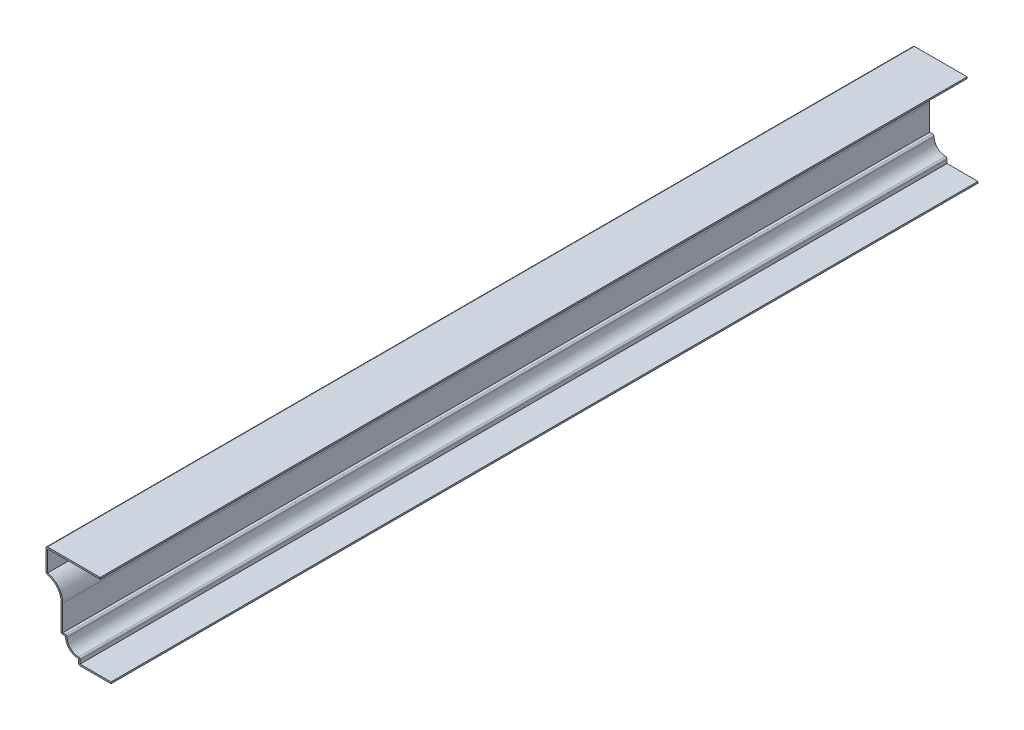
ISO-10303-21;
HEADER;
FILE_DESCRIPTION(('STEP AP214'),'2;1');
FILE_NAME('part.step','',(''),(''),'','','');
FILE_SCHEMA(('AUTOMOTIVE_DESIGN { 1 0 10303 214 1 1 1 1 }'));
ENDSEC;
DATA;
#1=APPLICATION_CONTEXT('core data for automotive mechanical design processes');
#2=APPLICATION_PROTOCOL_DEFINITION('international standard','automotive_design',2000,#1);
#3=PRODUCT_CONTEXT('',#1,'mechanical');
#4=PRODUCT('Part','Part','',(#3));
#5=PRODUCT_RELATED_PRODUCT_CATEGORY('part','',(#4));
#6=PRODUCT_DEFINITION_FORMATION('','',#4);
#7=PRODUCT_DEFINITION_CONTEXT('part definition',#1,'design');
#8=PRODUCT_DEFINITION('design','',#6,#7);
#9=PRODUCT_DEFINITION_SHAPE('','',#8);
#10=(LENGTH_UNIT() NAMED_UNIT(*) SI_UNIT(.MILLI.,.METRE.));
#11=(NAMED_UNIT(*) PLANE_ANGLE_UNIT() SI_UNIT($,.RADIAN.));
#12=(NAMED_UNIT(*) SI_UNIT($,.STERADIAN.) SOLID_ANGLE_UNIT());
#13=UNCERTAINTY_MEASURE_WITH_UNIT(LENGTH_MEASURE(1.E-05),#10,'distance_accuracy_value','');
#14=(GEOMETRIC_REPRESENTATION_CONTEXT(3) GLOBAL_UNCERTAINTY_ASSIGNED_CONTEXT((#13)) GLOBAL_UNIT_ASSIGNED_CONTEXT((#10,
#11,#12)) REPRESENTATION_CONTEXT('',''));
#15=CARTESIAN_POINT('',(0.,0.,0.));
#16=DIRECTION('',(0.,0.,1.));
#17=DIRECTION('',(1.,0.,0.));
#18=AXIS2_PLACEMENT_3D('',#15,#16,#17);
#19=CARTESIAN_POINT('',(-47.625,62.357,-635.));
#20=DIRECTION('',(0.,-1.,0.));
#21=DIRECTION('',(0.,0.,-1.));
#22=AXIS2_PLACEMENT_3D('',#19,#20,#21);
#23=PLANE('',#22);
#24=DIRECTION('',(1.,0.,0.));
#25=VECTOR('',#24,1.);
#26=CARTESIAN_POINT('',(-47.625,62.357,0.));
#27=LINE('',#26,#25);
#28=CARTESIAN_POINT('',(-46.482,62.357,0.));
#29=VERTEX_POINT('',#28);
#30=CARTESIAN_POINT('',(-7.9375,62.357,0.));
#31=VERTEX_POINT('',#30);
#32=EDGE_CURVE('E265',#29,#31,#27,.T.);
#33=ORIENTED_EDGE('',*,*,#32,.F.);
#34=DIRECTION('',(0.,0.,1.));
#35=VECTOR('',#34,1.);
#36=CARTESIAN_POINT('',(-46.482,62.357,-635.));
#37=LINE('',#36,#35);
#38=CARTESIAN_POINT('',(-46.482,62.357,-635.));
#39=VERTEX_POINT('',#38);
#40=EDGE_CURVE('E221',#39,#29,#37,.T.);
#41=ORIENTED_EDGE('',*,*,#40,.F.);
#42=DIRECTION('',(1.,0.,0.));
#43=VECTOR('',#42,1.);
#44=CARTESIAN_POINT('',(-47.625,62.357,-635.));
#45=LINE('',#44,#43);
#46=CARTESIAN_POINT('',(-7.9375,62.357,-635.));
#47=VERTEX_POINT('',#46);
#48=EDGE_CURVE('E203',#39,#47,#45,.T.);
#49=ORIENTED_EDGE('',*,*,#48,.T.);
#50=DIRECTION('',(0.,0.,1.));
#51=VECTOR('',#50,1.);
#52=CARTESIAN_POINT('',(-7.9375,62.357,-635.));
#53=LINE('',#52,#51);
#54=EDGE_CURVE('E211',#47,#31,#53,.T.);
#55=ORIENTED_EDGE('',*,*,#54,.T.);
#56=EDGE_LOOP('',(#33,#41,#49,#55));
#57=FACE_BOUND('',#56,.T.);
#58=ADVANCED_FACE('F35',(#57),#23,.T.);
#59=CARTESIAN_POINT('',(-46.482,46.0375,-635.));
#60=DIRECTION('',(1.,0.,0.));
#61=DIRECTION('',(0.,0.,-1.));
#62=AXIS2_PLACEMENT_3D('',#59,#60,#61);
#63=PLANE('',#62);
#64=DIRECTION('',(0.,1.,0.));
#65=VECTOR('',#64,1.);
#66=CARTESIAN_POINT('',(-46.482,46.0375,0.));
#67=LINE('',#66,#65);
#68=CARTESIAN_POINT('',(-46.482,47.0081454045131,0.));
#69=VERTEX_POINT('',#68);
#70=EDGE_CURVE('E222',#69,#29,#67,.T.);
#71=ORIENTED_EDGE('',*,*,#70,.F.);
#72=DIRECTION('',(0.,0.,1.));
#73=VECTOR('',#72,1.);
#74=CARTESIAN_POINT('',(-46.482,47.0081454045131,-635.));
#75=LINE('',#74,#73);
#76=CARTESIAN_POINT('',(-46.482,47.0081454045131,-635.));
#77=VERTEX_POINT('',#76);
#78=EDGE_CURVE('E307',#77,#69,#75,.T.);
#79=ORIENTED_EDGE('',*,*,#78,.F.);
#80=DIRECTION('',(0.,1.,0.));
#81=VECTOR('',#80,1.);
#82=CARTESIAN_POINT('',(-46.482,46.0375,-635.));
#83=LINE('',#82,#81);
#84=EDGE_CURVE('E219',#77,#39,#83,.T.);
#85=ORIENTED_EDGE('',*,*,#84,.T.);
#86=ORIENTED_EDGE('',*,*,#40,.T.);
#87=EDGE_LOOP('',(#71,#79,#85,#86));
#88=FACE_BOUND('',#87,.T.);
#89=ADVANCED_FACE('F400',(#88),#63,.T.);
#90=CARTESIAN_POINT('',(-49.2125,33.4371093810549,-635.));
#91=DIRECTION('',(0.,0.,1.));
#92=DIRECTION('',(1.,0.,0.));
#93=AXIS2_PLACEMENT_3D('',#90,#91,#92);
#94=CYLINDRICAL_SURFACE('',#93,13.843);
#95=CARTESIAN_POINT('',(-49.2125,33.4371093810549,0.));
#96=DIRECTION('',(0.,0.,1.));
#97=DIRECTION('',(1.,0.,0.));
#98=AXIS2_PLACEMENT_3D('',#95,#96,#97);
#99=CIRCLE('',#98,13.843);
#100=CARTESIAN_POINT('',(-35.3695,33.4371093810549,0.));
#101=VERTEX_POINT('',#100);
#102=EDGE_CURVE('E225',#101,#69,#99,.T.);
#103=ORIENTED_EDGE('',*,*,#102,.F.);
#104=DIRECTION('',(0.,0.,1.));
#105=VECTOR('',#104,1.);
#106=CARTESIAN_POINT('',(-35.3695,33.4371093810549,-635.));
#107=LINE('',#106,#105);
#108=CARTESIAN_POINT('',(-35.3695,33.4371093810549,-635.));
#109=VERTEX_POINT('',#108);
#110=EDGE_CURVE('E309',#109,#101,#107,.T.);
#111=ORIENTED_EDGE('',*,*,#110,.F.);
#112=CARTESIAN_POINT('',(-49.2125,33.4371093810549,-635.));
#113=DIRECTION('',(0.,0.,1.));
#114=DIRECTION('',(1.,0.,0.));
#115=AXIS2_PLACEMENT_3D('',#112,#113,#114);
#116=CIRCLE('',#115,13.843);
#117=EDGE_CURVE('E261',#109,#77,#116,.T.);
#118=ORIENTED_EDGE('',*,*,#117,.T.);
#119=ORIENTED_EDGE('',*,*,#78,.T.);
#120=EDGE_LOOP('',(#103,#111,#118,#119));
#121=FACE_BOUND('',#120,.T.);
#122=ADVANCED_FACE('F481',(#121),#94,.T.);
#123=CARTESIAN_POINT('',(-35.3695,13.49375,-635.));
#124=DIRECTION('',(1.,0.,0.));
#125=DIRECTION('',(0.,1.,0.));
#126=AXIS2_PLACEMENT_3D('',#123,#124,#125);
#127=PLANE('',#126);
#128=DIRECTION('',(0.,1.,0.));
#129=VECTOR('',#128,1.);
#130=CARTESIAN_POINT('',(-35.3695,13.49375,0.));
#131=LINE('',#130,#129);
#132=CARTESIAN_POINT('',(-35.3695,14.63675,0.));
#133=VERTEX_POINT('',#132);
#134=EDGE_CURVE('E300',#133,#101,#131,.T.);
#135=ORIENTED_EDGE('',*,*,#134,.F.);
#136=DIRECTION('',(0.,0.,1.));
#137=VECTOR('',#136,1.);
#138=CARTESIAN_POINT('',(-35.3695,14.63675,-635.));
#139=LINE('',#138,#137);
#140=CARTESIAN_POINT('',(-35.3695,14.63675,-635.));
#141=VERTEX_POINT('',#140);
#142=EDGE_CURVE('E311',#141,#133,#139,.T.);
#143=ORIENTED_EDGE('',*,*,#142,.F.);
#144=DIRECTION('',(0.,1.,0.));
#145=VECTOR('',#144,1.);
#146=CARTESIAN_POINT('',(-35.3695,13.49375,-635.));
#147=LINE('',#146,#145);
#148=EDGE_CURVE('E258',#141,#109,#147,.T.);
#149=ORIENTED_EDGE('',*,*,#148,.T.);
#150=ORIENTED_EDGE('',*,*,#110,.T.);
#151=EDGE_LOOP('',(#135,#143,#149,#150));
#152=FACE_BOUND('',#151,.T.);
#153=ADVANCED_FACE('F408',(#152),#127,.T.);
#154=CARTESIAN_POINT('',(-33.3375,14.63675,-635.));
#155=DIRECTION('',(0.,1.,0.));
#156=DIRECTION('',(0.,0.,1.));
#157=AXIS2_PLACEMENT_3D('',#154,#155,#156);
#158=PLANE('',#157);
#159=DIRECTION('',(1.,0.,0.));
#160=VECTOR('',#159,1.);
#161=CARTESIAN_POINT('',(-33.3375,14.63675,0.));
#162=LINE('',#161,#160);
#163=CARTESIAN_POINT('',(-33.3375,14.63675,0.));
#164=VERTEX_POINT('',#163);
#165=EDGE_CURVE('E298',#164,#133,#162,.F.);
#166=ORIENTED_EDGE('',*,*,#165,.F.);
#167=DIRECTION('',(0.,0.,1.));
#168=VECTOR('',#167,1.);
#169=CARTESIAN_POINT('',(-33.3375,14.63675,-635.));
#170=LINE('',#169,#168);
#171=CARTESIAN_POINT('',(-33.3375,14.63675,-635.));
#172=VERTEX_POINT('',#171);
#173=EDGE_CURVE('E366',#164,#172,#170,.F.);
#174=ORIENTED_EDGE('',*,*,#173,.T.);
#175=DIRECTION('',(1.,0.,0.));
#176=VECTOR('',#175,1.);
#177=CARTESIAN_POINT('',(-33.3375,14.63675,-635.));
#178=LINE('',#177,#176);
#179=EDGE_CURVE('E256',#172,#141,#178,.F.);
#180=ORIENTED_EDGE('',*,*,#179,.T.);
#181=ORIENTED_EDGE('',*,*,#142,.T.);
#182=EDGE_LOOP('',(#166,#174,#180,#181));
#183=FACE_BOUND('',#182,.T.);
#184=ADVANCED_FACE('F411',(#183),#158,.T.);
#185=CARTESIAN_POINT('',(-23.8125,13.49375,-635.));
#186=DIRECTION('',(0.,0.,1.));
#187=DIRECTION('',(1.,0.,0.));
#188=AXIS2_PLACEMENT_3D('',#185,#186,#187);
#189=CYLINDRICAL_SURFACE('',#188,8.382);
#190=CARTESIAN_POINT('',(-23.8125,13.49375,0.));
#191=DIRECTION('',(0.,0.,1.));
#192=DIRECTION('',(1.,0.,0.));
#193=AXIS2_PLACEMENT_3D('',#190,#191,#192);
#194=CIRCLE('',#193,8.382);
#195=CARTESIAN_POINT('',(-23.8125,5.11175,0.));
#196=VERTEX_POINT('',#195);
#197=CARTESIAN_POINT('',(-32.1945,13.49375,0.));
#198=VERTEX_POINT('',#197);
#199=EDGE_CURVE('E295',#196,#198,#194,.F.);
#200=ORIENTED_EDGE('',*,*,#199,.F.);
#201=DIRECTION('',(0.,0.,1.));
#202=VECTOR('',#201,1.);
#203=CARTESIAN_POINT('',(-23.8125,5.11175,-635.));
#204=LINE('',#203,#202);
#205=CARTESIAN_POINT('',(-23.8125,5.11175,-635.));
#206=VERTEX_POINT('',#205);
#207=EDGE_CURVE('E364',#196,#206,#204,.F.);
#208=ORIENTED_EDGE('',*,*,#207,.T.);
#209=CARTESIAN_POINT('',(-23.8125,13.49375,-635.));
#210=DIRECTION('',(0.,0.,1.));
#211=DIRECTION('',(1.,0.,0.));
#212=AXIS2_PLACEMENT_3D('',#209,#210,#211);
#213=CIRCLE('',#212,8.382);
#214=CARTESIAN_POINT('',(-32.1945,13.49375,-635.));
#215=VERTEX_POINT('',#214);
#216=EDGE_CURVE('E253',#206,#215,#213,.F.);
#217=ORIENTED_EDGE('',*,*,#216,.T.);
#218=DIRECTION('',(0.,0.,1.));
#219=VECTOR('',#218,1.);
#220=CARTESIAN_POINT('',(-32.1945,13.49375,-635.));
#221=LINE('',#220,#219);
#222=EDGE_CURVE('E361',#215,#198,#221,.T.);
#223=ORIENTED_EDGE('',*,*,#222,.T.);
#224=EDGE_LOOP('',(#200,#208,#217,#223));
#225=FACE_BOUND('',#224,.T.);
#226=ADVANCED_FACE('F420',(#225),#189,.F.);
#227=CARTESIAN_POINT('',(-22.6695,0.,-635.));
#228=DIRECTION('',(1.,0.,0.));
#229=DIRECTION('',(0.,0.,-1.));
#230=AXIS2_PLACEMENT_3D('',#227,#228,#229);
#231=PLANE('',#230);
#232=DIRECTION('',(0.,1.,0.));
#233=VECTOR('',#232,1.);
#234=CARTESIAN_POINT('',(-22.6695,0.,-635.));
#235=LINE('',#234,#233);
#236=CARTESIAN_POINT('',(-22.6695,1.143,-635.));
#237=VERTEX_POINT('',#236);
#238=CARTESIAN_POINT('',(-22.6695,3.96875,-635.));
#239=VERTEX_POINT('',#238);
#240=EDGE_CURVE('E250',#237,#239,#235,.T.);
#241=ORIENTED_EDGE('',*,*,#240,.T.);
#242=DIRECTION('',(0.,0.,1.));
#243=VECTOR('',#242,1.);
#244=CARTESIAN_POINT('',(-22.6695,3.96875,-635.));
#245=LINE('',#244,#243);
#246=CARTESIAN_POINT('',(-22.6695,3.96875,0.));
#247=VERTEX_POINT('',#246);
#248=EDGE_CURVE('E358',#239,#247,#245,.T.);
#249=ORIENTED_EDGE('',*,*,#248,.T.);
#250=DIRECTION('',(0.,1.,0.));
#251=VECTOR('',#250,1.);
#252=CARTESIAN_POINT('',(-22.6695,0.,0.));
#253=LINE('',#252,#251);
#254=CARTESIAN_POINT('',(-22.6695,1.143,0.));
#255=VERTEX_POINT('',#254);
#256=EDGE_CURVE('E292',#255,#247,#253,.T.);
#257=ORIENTED_EDGE('',*,*,#256,.F.);
#258=DIRECTION('',(0.,0.,1.));
#259=VECTOR('',#258,1.);
#260=CARTESIAN_POINT('',(-22.6695,1.143,-635.));
#261=LINE('',#260,#259);
#262=EDGE_CURVE('E314',#237,#255,#261,.T.);
#263=ORIENTED_EDGE('',*,*,#262,.F.);
#264=EDGE_LOOP('',(#241,#249,#257,#263));
#265=FACE_BOUND('',#264,.T.);
#266=ADVANCED_FACE('F428',(#265),#231,.T.);
#267=CARTESIAN_POINT('',(0.,1.143,-635.));
#268=DIRECTION('',(0.,1.,0.));
#269=DIRECTION('',(-1.,0.,0.));
#270=AXIS2_PLACEMENT_3D('',#267,#268,#269);
#271=PLANE('',#270);
#272=DIRECTION('',(-1.,0.,0.));
#273=VECTOR('',#272,1.);
#274=CARTESIAN_POINT('',(0.,1.143,0.));
#275=LINE('',#274,#273);
#276=CARTESIAN_POINT('',(0.,1.143,0.));
#277=VERTEX_POINT('',#276);
#278=EDGE_CURVE('E289',#277,#255,#275,.T.);
#279=ORIENTED_EDGE('',*,*,#278,.F.);
#280=DIRECTION('',(0.,0.,1.));
#281=VECTOR('',#280,1.);
#282=CARTESIAN_POINT('',(0.,1.143,-635.));
#283=LINE('',#282,#281);
#284=CARTESIAN_POINT('',(0.,1.143,-635.));
#285=VERTEX_POINT('',#284);
#286=EDGE_CURVE('E316',#285,#277,#283,.T.);
#287=ORIENTED_EDGE('',*,*,#286,.F.);
#288=DIRECTION('',(-1.,0.,0.));
#289=VECTOR('',#288,1.);
#290=CARTESIAN_POINT('',(0.,1.143,-635.));
#291=LINE('',#290,#289);
#292=EDGE_CURVE('E247',#285,#237,#291,.T.);
#293=ORIENTED_EDGE('',*,*,#292,.T.);
#294=ORIENTED_EDGE('',*,*,#262,.T.);
#295=EDGE_LOOP('',(#279,#287,#293,#294));
#296=FACE_BOUND('',#295,.T.);
#297=ADVANCED_FACE('F433',(#296),#271,.T.);
#298=CARTESIAN_POINT('',(0.,1.143,-635.));
#299=DIRECTION('',(-1.,0.,0.));
#300=DIRECTION('',(0.,-1.,0.));
#301=AXIS2_PLACEMENT_3D('',#298,#299,#300);
#302=PLANE('',#301);
#303=DIRECTION('',(0.,-1.,0.));
#304=VECTOR('',#303,1.);
#305=CARTESIAN_POINT('',(0.,1.143,0.));
#306=LINE('',#305,#304);
#307=CARTESIAN_POINT('',(0.,0.,0.));
#308=VERTEX_POINT('',#307);
#309=EDGE_CURVE('E287',#277,#308,#306,.T.);
#310=ORIENTED_EDGE('',*,*,#309,.T.);
#311=DIRECTION('',(0.,0.,1.));
#312=VECTOR('',#311,1.);
#313=CARTESIAN_POINT('',(0.,0.,-635.));
#314=LINE('',#313,#312);
#315=CARTESIAN_POINT('',(0.,0.,-635.));
#316=VERTEX_POINT('',#315);
#317=EDGE_CURVE('E318',#316,#308,#314,.T.);
#318=ORIENTED_EDGE('',*,*,#317,.F.);
#319=DIRECTION('',(0.,-1.,0.));
#320=VECTOR('',#319,1.);
#321=CARTESIAN_POINT('',(0.,1.143,-635.));
#322=LINE('',#321,#320);
#323=EDGE_CURVE('E245',#285,#316,#322,.T.);
#324=ORIENTED_EDGE('',*,*,#323,.F.);
#325=ORIENTED_EDGE('',*,*,#286,.T.);
#326=EDGE_LOOP('',(#310,#318,#324,#325));
#327=FACE_BOUND('',#326,.T.);
#328=ADVANCED_FACE('F438',(#327),#302,.F.);
#329=CARTESIAN_POINT('',(0.,0.,-635.));
#330=DIRECTION('',(0.,1.,0.));
#331=DIRECTION('',(-1.,0.,0.));
#332=AXIS2_PLACEMENT_3D('',#329,#330,#331);
#333=PLANE('',#332);
#334=DIRECTION('',(-1.,0.,0.));
#335=VECTOR('',#334,1.);
#336=CARTESIAN_POINT('',(0.,0.,0.));
#337=LINE('',#336,#335);
#338=CARTESIAN_POINT('',(-22.6695,0.,0.));
#339=VERTEX_POINT('',#338);
#340=EDGE_CURVE('E284',#308,#339,#337,.T.);
#341=ORIENTED_EDGE('',*,*,#340,.T.);
#342=DIRECTION('',(0.,0.,1.));
#343=VECTOR('',#342,1.);
#344=CARTESIAN_POINT('',(-22.6695,0.,-635.));
#345=LINE('',#344,#343);
#346=CARTESIAN_POINT('',(-22.6695,0.,-635.));
#347=VERTEX_POINT('',#346);
#348=EDGE_CURVE('E345',#339,#347,#345,.F.);
#349=ORIENTED_EDGE('',*,*,#348,.T.);
#350=DIRECTION('',(-1.,0.,0.));
#351=VECTOR('',#350,1.);
#352=CARTESIAN_POINT('',(0.,0.,-635.));
#353=LINE('',#352,#351);
#354=EDGE_CURVE('E243',#316,#347,#353,.T.);
#355=ORIENTED_EDGE('',*,*,#354,.F.);
#356=ORIENTED_EDGE('',*,*,#317,.T.);
#357=EDGE_LOOP('',(#341,#349,#355,#356));
#358=FACE_BOUND('',#357,.T.);
#359=ADVANCED_FACE('F588',(#358),#333,.F.);
#360=CARTESIAN_POINT('',(-23.8125,0.,-635.));
#361=DIRECTION('',(1.,0.,0.));
#362=DIRECTION('',(0.,0.,-1.));
#363=AXIS2_PLACEMENT_3D('',#360,#361,#362);
#364=PLANE('',#363);
#365=DIRECTION('',(0.,1.,0.));
#366=VECTOR('',#365,1.);
#367=CARTESIAN_POINT('',(-23.8125,0.,-635.));
#368=LINE('',#367,#366);
#369=CARTESIAN_POINT('',(-23.8125,1.143,-635.));
#370=VERTEX_POINT('',#369);
#371=CARTESIAN_POINT('',(-23.8125,3.96875,-635.));
#372=VERTEX_POINT('',#371);
#373=EDGE_CURVE('E241',#370,#372,#368,.T.);
#374=ORIENTED_EDGE('',*,*,#373,.F.);
#375=DIRECTION('',(0.,0.,1.));
#376=VECTOR('',#375,1.);
#377=CARTESIAN_POINT('',(-23.8125,1.143,-635.));
#378=LINE('',#377,#376);
#379=CARTESIAN_POINT('',(-23.8125,1.143,0.));
#380=VERTEX_POINT('',#379);
#381=EDGE_CURVE('E306',#370,#380,#378,.T.);
#382=ORIENTED_EDGE('',*,*,#381,.T.);
#383=DIRECTION('',(0.,1.,0.));
#384=VECTOR('',#383,1.);
#385=CARTESIAN_POINT('',(-23.8125,0.,0.));
#386=LINE('',#385,#384);
#387=CARTESIAN_POINT('',(-23.8125,3.96875,0.));
#388=VERTEX_POINT('',#387);
#389=EDGE_CURVE('E282',#380,#388,#386,.T.);
#390=ORIENTED_EDGE('',*,*,#389,.T.);
#391=DIRECTION('',(0.,0.,1.));
#392=VECTOR('',#391,1.);
#393=CARTESIAN_POINT('',(-23.8125,3.96875,-635.));
#394=LINE('',#393,#392);
#395=EDGE_CURVE('E321',#372,#388,#394,.T.);
#396=ORIENTED_EDGE('',*,*,#395,.F.);
#397=EDGE_LOOP('',(#374,#382,#390,#396));
#398=FACE_BOUND('',#397,.T.);
#399=ADVANCED_FACE('F448',(#398),#364,.F.);
#400=CARTESIAN_POINT('',(-23.8125,13.49375,-635.));
#401=DIRECTION('',(0.,0.,1.));
#402=DIRECTION('',(1.,0.,0.));
#403=AXIS2_PLACEMENT_3D('',#400,#401,#402);
#404=CYLINDRICAL_SURFACE('',#403,9.525);
#405=CARTESIAN_POINT('',(-23.8125,13.49375,0.));
#406=DIRECTION('',(0.,0.,-1.));
#407=DIRECTION('',(-1.,0.,0.));
#408=AXIS2_PLACEMENT_3D('',#405,#406,#407);
#409=CIRCLE('',#408,9.525);
#410=CARTESIAN_POINT('',(-33.3375,13.49375,0.));
#411=VERTEX_POINT('',#410);
#412=EDGE_CURVE('E280',#388,#411,#409,.T.);
#413=ORIENTED_EDGE('',*,*,#412,.T.);
#414=DIRECTION('',(0.,0.,1.));
#415=VECTOR('',#414,1.);
#416=CARTESIAN_POINT('',(-33.3375,13.49375,-635.));
#417=LINE('',#416,#415);
#418=CARTESIAN_POINT('',(-33.3375,13.49375,-635.));
#419=VERTEX_POINT('',#418);
#420=EDGE_CURVE('E324',#419,#411,#417,.T.);
#421=ORIENTED_EDGE('',*,*,#420,.F.);
#422=CARTESIAN_POINT('',(-23.8125,13.49375,-635.));
#423=DIRECTION('',(0.,0.,-1.));
#424=DIRECTION('',(-1.,0.,0.));
#425=AXIS2_PLACEMENT_3D('',#422,#423,#424);
#426=CIRCLE('',#425,9.525);
#427=EDGE_CURVE('E239',#372,#419,#426,.T.);
#428=ORIENTED_EDGE('',*,*,#427,.F.);
#429=ORIENTED_EDGE('',*,*,#395,.T.);
#430=EDGE_LOOP('',(#413,#421,#428,#429));
#431=FACE_BOUND('',#430,.T.);
#432=ADVANCED_FACE('F455',(#431),#404,.T.);
#433=CARTESIAN_POINT('',(-33.3375,13.49375,-635.));
#434=DIRECTION('',(0.,1.,0.));
#435=DIRECTION('',(0.,0.,1.));
#436=AXIS2_PLACEMENT_3D('',#433,#434,#435);
#437=PLANE('',#436);
#438=DIRECTION('',(-1.,0.,0.));
#439=VECTOR('',#438,1.);
#440=CARTESIAN_POINT('',(-33.3375,13.49375,0.));
#441=LINE('',#440,#439);
#442=CARTESIAN_POINT('',(-35.3695,13.49375,0.));
#443=VERTEX_POINT('',#442);
#444=EDGE_CURVE('E277',#411,#443,#441,.T.);
#445=ORIENTED_EDGE('',*,*,#444,.T.);
#446=DIRECTION('',(0.,0.,1.));
#447=VECTOR('',#446,1.);
#448=CARTESIAN_POINT('',(-35.3695,13.49375,-635.));
#449=LINE('',#448,#447);
#450=CARTESIAN_POINT('',(-35.3695,13.49375,-635.));
#451=VERTEX_POINT('',#450);
#452=EDGE_CURVE('E371',#443,#451,#449,.F.);
#453=ORIENTED_EDGE('',*,*,#452,.T.);
#454=DIRECTION('',(-1.,0.,0.));
#455=VECTOR('',#454,1.);
#456=CARTESIAN_POINT('',(-33.3375,13.49375,-635.));
#457=LINE('',#456,#455);
#458=EDGE_CURVE('E236',#419,#451,#457,.T.);
#459=ORIENTED_EDGE('',*,*,#458,.F.);
#460=ORIENTED_EDGE('',*,*,#420,.T.);
#461=EDGE_LOOP('',(#445,#453,#459,#460));
#462=FACE_BOUND('',#461,.T.);
#463=ADVANCED_FACE('F459',(#462),#437,.F.);
#464=CARTESIAN_POINT('',(-36.5125,13.49375,-635.));
#465=DIRECTION('',(1.,0.,0.));
#466=DIRECTION('',(0.,1.,0.));
#467=AXIS2_PLACEMENT_3D('',#464,#465,#466);
#468=PLANE('',#467);
#469=DIRECTION('',(0.,1.,0.));
#470=VECTOR('',#469,1.);
#471=CARTESIAN_POINT('',(-36.5125,13.49375,-635.));
#472=LINE('',#471,#470);
#473=CARTESIAN_POINT('',(-36.5125,14.63675,-635.));
#474=VERTEX_POINT('',#473);
#475=CARTESIAN_POINT('',(-36.5125,33.4371093810549,-635.));
#476=VERTEX_POINT('',#475);
#477=EDGE_CURVE('E234',#474,#476,#472,.T.);
#478=ORIENTED_EDGE('',*,*,#477,.F.);
#479=DIRECTION('',(0.,0.,1.));
#480=VECTOR('',#479,1.);
#481=CARTESIAN_POINT('',(-36.5125,14.63675,-635.));
#482=LINE('',#481,#480);
#483=CARTESIAN_POINT('',(-36.5125,14.63675,0.));
#484=VERTEX_POINT('',#483);
#485=EDGE_CURVE('E368',#474,#484,#482,.T.);
#486=ORIENTED_EDGE('',*,*,#485,.T.);
#487=DIRECTION('',(0.,1.,0.));
#488=VECTOR('',#487,1.);
#489=CARTESIAN_POINT('',(-36.5125,13.49375,0.));
#490=LINE('',#489,#488);
#491=CARTESIAN_POINT('',(-36.5125,33.4371093810549,0.));
#492=VERTEX_POINT('',#491);
#493=EDGE_CURVE('E275',#484,#492,#490,.T.);
#494=ORIENTED_EDGE('',*,*,#493,.T.);
#495=DIRECTION('',(0.,0.,1.));
#496=VECTOR('',#495,1.);
#497=CARTESIAN_POINT('',(-36.5125,33.4371093810549,-635.));
#498=LINE('',#497,#496);
#499=EDGE_CURVE('E327',#476,#492,#498,.T.);
#500=ORIENTED_EDGE('',*,*,#499,.F.);
#501=EDGE_LOOP('',(#478,#486,#494,#500));
#502=FACE_BOUND('',#501,.T.);
#503=ADVANCED_FACE('F467',(#502),#468,.F.);
#504=CARTESIAN_POINT('',(-49.2125,33.4371093810549,-635.));
#505=DIRECTION('',(0.,0.,1.));
#506=DIRECTION('',(1.,0.,0.));
#507=AXIS2_PLACEMENT_3D('',#504,#505,#506);
#508=CYLINDRICAL_SURFACE('',#507,12.7);
#509=CARTESIAN_POINT('',(-49.2125,33.4371093810549,0.));
#510=DIRECTION('',(0.,0.,1.));
#511=DIRECTION('',(1.,0.,0.));
#512=AXIS2_PLACEMENT_3D('',#509,#510,#511);
#513=CIRCLE('',#512,12.7);
#514=CARTESIAN_POINT('',(-46.7074541284404,45.8876011456954,0.));
#515=VERTEX_POINT('',#514);
#516=EDGE_CURVE('E272',#492,#515,#513,.T.);
#517=ORIENTED_EDGE('',*,*,#516,.T.);
#518=DIRECTION('',(0.,0.,1.));
#519=VECTOR('',#518,1.);
#520=CARTESIAN_POINT('',(-46.7074541284404,45.8876011456954,-635.));
#521=LINE('',#520,#519);
#522=CARTESIAN_POINT('',(-46.7074541284404,45.8876011456954,-635.));
#523=VERTEX_POINT('',#522);
#524=EDGE_CURVE('E43',#515,#523,#521,.F.);
#525=ORIENTED_EDGE('',*,*,#524,.T.);
#526=CARTESIAN_POINT('',(-49.2125,33.4371093810549,-635.));
#527=DIRECTION('',(0.,0.,1.));
#528=DIRECTION('',(1.,0.,0.));
#529=AXIS2_PLACEMENT_3D('',#526,#527,#528);
#530=CIRCLE('',#529,12.7);
#531=EDGE_CURVE('E231',#476,#523,#530,.T.);
#532=ORIENTED_EDGE('',*,*,#531,.F.);
#533=ORIENTED_EDGE('',*,*,#499,.T.);
#534=EDGE_LOOP('',(#517,#525,#532,#533));
#535=FACE_BOUND('',#534,.T.);
#536=ADVANCED_FACE('F379',(#535),#508,.F.);
#537=CARTESIAN_POINT('',(-47.625,46.0375,-635.));
#538=DIRECTION('',(1.,0.,0.));
#539=DIRECTION('',(0.,0.,-1.));
#540=AXIS2_PLACEMENT_3D('',#537,#538,#539);
#541=PLANE('',#540);
#542=DIRECTION('',(0.,1.,0.));
#543=VECTOR('',#542,1.);
#544=CARTESIAN_POINT('',(-47.625,46.0375,-635.));
#545=LINE('',#544,#543);
#546=CARTESIAN_POINT('',(-47.625,47.0081454045131,-635.));
#547=VERTEX_POINT('',#546);
#548=CARTESIAN_POINT('',(-47.625,62.357,-635.));
#549=VERTEX_POINT('',#548);
#550=EDGE_CURVE('E229',#547,#549,#545,.T.);
#551=ORIENTED_EDGE('',*,*,#550,.F.);
#552=DIRECTION('',(0.,0.,1.));
#553=VECTOR('',#552,1.);
#554=CARTESIAN_POINT('',(-47.625,47.0081454045131,-635.));
#555=LINE('',#554,#553);
#556=CARTESIAN_POINT('',(-47.625,47.0081454045131,0.));
#557=VERTEX_POINT('',#556);
#558=EDGE_CURVE('E374',#547,#557,#555,.T.);
#559=ORIENTED_EDGE('',*,*,#558,.T.);
#560=DIRECTION('',(0.,1.,0.));
#561=VECTOR('',#560,1.);
#562=CARTESIAN_POINT('',(-47.625,46.0375,0.));
#563=LINE('',#562,#561);
#564=CARTESIAN_POINT('',(-47.625,62.357,0.));
#565=VERTEX_POINT('',#564);
#566=EDGE_CURVE('E270',#557,#565,#563,.T.);
#567=ORIENTED_EDGE('',*,*,#566,.T.);
#568=DIRECTION('',(0.,0.,1.));
#569=VECTOR('',#568,1.);
#570=CARTESIAN_POINT('',(-47.625,62.357,-635.));
#571=LINE('',#570,#569);
#572=EDGE_CURVE('E58',#565,#549,#571,.F.);
#573=ORIENTED_EDGE('',*,*,#572,.T.);
#574=EDGE_LOOP('',(#551,#559,#567,#573));
#575=FACE_BOUND('',#574,.T.);
#576=ADVANCED_FACE('F388',(#575),#541,.F.);
#577=CARTESIAN_POINT('',(-47.625,63.5,-635.));
#578=DIRECTION('',(0.,-1.,0.));
#579=DIRECTION('',(0.,0.,-1.));
#580=AXIS2_PLACEMENT_3D('',#577,#578,#579);
#581=PLANE('',#580);
#582=DIRECTION('',(1.,0.,0.));
#583=VECTOR('',#582,1.);
#584=CARTESIAN_POINT('',(-47.625,63.5,-635.));
#585=LINE('',#584,#583);
#586=CARTESIAN_POINT('',(-46.482,63.5,-635.));
#587=VERTEX_POINT('',#586);
#588=CARTESIAN_POINT('',(-7.9375,63.5,-635.));
#589=VERTEX_POINT('',#588);
#590=EDGE_CURVE('E205',#587,#589,#585,.T.);
#591=ORIENTED_EDGE('',*,*,#590,.F.);
#592=DIRECTION('',(0.,0.,1.));
#593=VECTOR('',#592,1.);
#594=CARTESIAN_POINT('',(-46.482,63.5,-635.));
#595=LINE('',#594,#593);
#596=CARTESIAN_POINT('',(-46.482,63.5,0.));
#597=VERTEX_POINT('',#596);
#598=EDGE_CURVE('E11',#587,#597,#595,.T.);
#599=ORIENTED_EDGE('',*,*,#598,.T.);
#600=DIRECTION('',(1.,0.,0.));
#601=VECTOR('',#600,1.);
#602=CARTESIAN_POINT('',(-47.625,63.5,0.));
#603=LINE('',#602,#601);
#604=CARTESIAN_POINT('',(-7.9375,63.5,0.));
#605=VERTEX_POINT('',#604);
#606=EDGE_CURVE('E268',#597,#605,#603,.T.);
#607=ORIENTED_EDGE('',*,*,#606,.T.);
#608=DIRECTION('',(0.,0.,1.));
#609=VECTOR('',#608,1.);
#610=CARTESIAN_POINT('',(-7.9375,63.5,-635.));
#611=LINE('',#610,#609);
#612=EDGE_CURVE('E218',#589,#605,#611,.T.);
#613=ORIENTED_EDGE('',*,*,#612,.F.);
#614=EDGE_LOOP('',(#591,#599,#607,#613));
#615=FACE_BOUND('',#614,.T.);
#616=ADVANCED_FACE('F396',(#615),#581,.F.);
#617=CARTESIAN_POINT('',(-7.9375,63.5,-635.));
#618=DIRECTION('',(-1.,0.,0.));
#619=DIRECTION('',(0.,0.,1.));
#620=AXIS2_PLACEMENT_3D('',#617,#618,#619);
#621=PLANE('',#620);
#622=DIRECTION('',(0.,-1.,0.));
#623=VECTOR('',#622,1.);
#624=CARTESIAN_POINT('',(-7.9375,63.5,0.));
#625=LINE('',#624,#623);
#626=EDGE_CURVE('E214',#605,#31,#625,.T.);
#627=ORIENTED_EDGE('',*,*,#626,.T.);
#628=ORIENTED_EDGE('',*,*,#54,.F.);
#629=DIRECTION('',(0.,-1.,0.));
#630=VECTOR('',#629,1.);
#631=CARTESIAN_POINT('',(-7.9375,63.5,-635.));
#632=LINE('',#631,#630);
#633=EDGE_CURVE('E197',#589,#47,#632,.T.);
#634=ORIENTED_EDGE('',*,*,#633,.F.);
#635=ORIENTED_EDGE('',*,*,#612,.T.);
#636=EDGE_LOOP('',(#627,#628,#634,#635));
#637=FACE_BOUND('',#636,.T.);
#638=ADVANCED_FACE('F212',(#637),#621,.F.);
#639=CARTESIAN_POINT('',(-49.2125,33.4371093810549,-635.));
#640=DIRECTION('',(0.,0.,1.));
#641=DIRECTION('',(1.,0.,0.));
#642=AXIS2_PLACEMENT_3D('',#639,#640,#641);
#643=PLANE('',#642);
#644=ORIENTED_EDGE('',*,*,#354,.T.);
#645=CARTESIAN_POINT('',(-22.6695,1.143,-635.));
#646=DIRECTION('',(0.,0.,1.));
#647=DIRECTION('',(1.,0.,0.));
#648=AXIS2_PLACEMENT_3D('',#645,#646,#647);
#649=CIRCLE('',#648,1.143);
#650=EDGE_CURVE('E356',#347,#370,#649,.F.);
#651=ORIENTED_EDGE('',*,*,#650,.T.);
#652=ORIENTED_EDGE('',*,*,#373,.T.);
#653=ORIENTED_EDGE('',*,*,#427,.T.);
#654=ORIENTED_EDGE('',*,*,#458,.T.);
#655=CARTESIAN_POINT('',(-35.3695,14.63675,-635.));
#656=DIRECTION('',(0.,0.,1.));
#657=DIRECTION('',(1.,0.,0.));
#658=AXIS2_PLACEMENT_3D('',#655,#656,#657);
#659=CIRCLE('',#658,1.143);
#660=EDGE_CURVE('E350',#451,#474,#659,.F.);
#661=ORIENTED_EDGE('',*,*,#660,.T.);
#662=ORIENTED_EDGE('',*,*,#477,.T.);
#663=ORIENTED_EDGE('',*,*,#531,.T.);
#664=CARTESIAN_POINT('',(-46.482,47.0081454045131,-635.));
#665=DIRECTION('',(0.,0.,1.));
#666=DIRECTION('',(1.,0.,0.));
#667=AXIS2_PLACEMENT_3D('',#664,#665,#666);
#668=CIRCLE('',#667,1.143);
#669=EDGE_CURVE('E348',#523,#547,#668,.F.);
#670=ORIENTED_EDGE('',*,*,#669,.T.);
#671=ORIENTED_EDGE('',*,*,#550,.T.);
#672=CARTESIAN_POINT('',(-46.482,62.357,-635.));
#673=DIRECTION('',(0.,0.,1.));
#674=DIRECTION('',(1.,0.,0.));
#675=AXIS2_PLACEMENT_3D('',#672,#673,#674);
#676=CIRCLE('',#675,1.143);
#677=EDGE_CURVE('E50',#549,#587,#676,.F.);
#678=ORIENTED_EDGE('',*,*,#677,.T.);
#679=ORIENTED_EDGE('',*,*,#590,.T.);
#680=ORIENTED_EDGE('',*,*,#633,.T.);
#681=ORIENTED_EDGE('',*,*,#48,.F.);
#682=ORIENTED_EDGE('',*,*,#84,.F.);
#683=ORIENTED_EDGE('',*,*,#117,.F.);
#684=ORIENTED_EDGE('',*,*,#148,.F.);
#685=ORIENTED_EDGE('',*,*,#179,.F.);
#686=CARTESIAN_POINT('',(-33.3375,13.49375,-635.));
#687=DIRECTION('',(0.,0.,1.));
#688=DIRECTION('',(1.,0.,0.));
#689=AXIS2_PLACEMENT_3D('',#686,#687,#688);
#690=CIRCLE('',#689,1.143);
#691=EDGE_CURVE('E352',#172,#215,#690,.F.);
#692=ORIENTED_EDGE('',*,*,#691,.T.);
#693=ORIENTED_EDGE('',*,*,#216,.F.);
#694=CARTESIAN_POINT('',(-23.8125,3.96875,-635.));
#695=DIRECTION('',(0.,0.,1.));
#696=DIRECTION('',(1.,0.,0.));
#697=AXIS2_PLACEMENT_3D('',#694,#695,#696);
#698=CIRCLE('',#697,1.143);
#699=EDGE_CURVE('E354',#206,#239,#698,.F.);
#700=ORIENTED_EDGE('',*,*,#699,.T.);
#701=ORIENTED_EDGE('',*,*,#240,.F.);
#702=ORIENTED_EDGE('',*,*,#292,.F.);
#703=ORIENTED_EDGE('',*,*,#323,.T.);
#704=EDGE_LOOP('',(#644,#651,#652,#653,#654,#661,#662,#663,#670,#671,#678,#679,#680,#681,#682,
#683,#684,#685,#692,#693,#700,#701,#702,#703));
#705=FACE_BOUND('',#704,.T.);
#706=ADVANCED_FACE('F200',(#705),#643,.F.);
#707=CARTESIAN_POINT('',(-49.2125,33.4371093810549,0.));
#708=DIRECTION('',(0.,0.,1.));
#709=DIRECTION('',(1.,0.,0.));
#710=AXIS2_PLACEMENT_3D('',#707,#708,#709);
#711=PLANE('',#710);
#712=ORIENTED_EDGE('',*,*,#389,.F.);
#713=CARTESIAN_POINT('',(-22.6695,1.143,0.));
#714=DIRECTION('',(0.,0.,1.));
#715=DIRECTION('',(1.,0.,0.));
#716=AXIS2_PLACEMENT_3D('',#713,#714,#715);
#717=CIRCLE('',#716,1.143);
#718=EDGE_CURVE('E343',#380,#339,#717,.T.);
#719=ORIENTED_EDGE('',*,*,#718,.T.);
#720=ORIENTED_EDGE('',*,*,#340,.F.);
#721=ORIENTED_EDGE('',*,*,#309,.F.);
#722=ORIENTED_EDGE('',*,*,#278,.T.);
#723=ORIENTED_EDGE('',*,*,#256,.T.);
#724=CARTESIAN_POINT('',(-23.8125,3.96875,0.));
#725=DIRECTION('',(0.,0.,1.));
#726=DIRECTION('',(1.,0.,0.));
#727=AXIS2_PLACEMENT_3D('',#724,#725,#726);
#728=CIRCLE('',#727,1.143);
#729=EDGE_CURVE('E341',#247,#196,#728,.T.);
#730=ORIENTED_EDGE('',*,*,#729,.T.);
#731=ORIENTED_EDGE('',*,*,#199,.T.);
#732=CARTESIAN_POINT('',(-33.3375,13.49375,0.));
#733=DIRECTION('',(0.,0.,1.));
#734=DIRECTION('',(1.,0.,0.));
#735=AXIS2_PLACEMENT_3D('',#732,#733,#734);
#736=CIRCLE('',#735,1.143);
#737=EDGE_CURVE('E339',#198,#164,#736,.T.);
#738=ORIENTED_EDGE('',*,*,#737,.T.);
#739=ORIENTED_EDGE('',*,*,#165,.T.);
#740=ORIENTED_EDGE('',*,*,#134,.T.);
#741=ORIENTED_EDGE('',*,*,#102,.T.);
#742=ORIENTED_EDGE('',*,*,#70,.T.);
#743=ORIENTED_EDGE('',*,*,#32,.T.);
#744=ORIENTED_EDGE('',*,*,#626,.F.);
#745=ORIENTED_EDGE('',*,*,#606,.F.);
#746=CARTESIAN_POINT('',(-46.482,62.357,0.));
#747=DIRECTION('',(0.,0.,1.));
#748=DIRECTION('',(1.,0.,0.));
#749=AXIS2_PLACEMENT_3D('',#746,#747,#748);
#750=CIRCLE('',#749,1.143);
#751=EDGE_CURVE('E333',#597,#565,#750,.T.);
#752=ORIENTED_EDGE('',*,*,#751,.T.);
#753=ORIENTED_EDGE('',*,*,#566,.F.);
#754=CARTESIAN_POINT('',(-46.482,47.0081454045131,0.));
#755=DIRECTION('',(0.,0.,1.));
#756=DIRECTION('',(1.,0.,0.));
#757=AXIS2_PLACEMENT_3D('',#754,#755,#756);
#758=CIRCLE('',#757,1.143);
#759=EDGE_CURVE('E335',#557,#515,#758,.T.);
#760=ORIENTED_EDGE('',*,*,#759,.T.);
#761=ORIENTED_EDGE('',*,*,#516,.F.);
#762=ORIENTED_EDGE('',*,*,#493,.F.);
#763=CARTESIAN_POINT('',(-35.3695,14.63675,0.));
#764=DIRECTION('',(0.,0.,1.));
#765=DIRECTION('',(1.,0.,0.));
#766=AXIS2_PLACEMENT_3D('',#763,#764,#765);
#767=CIRCLE('',#766,1.143);
#768=EDGE_CURVE('E337',#484,#443,#767,.T.);
#769=ORIENTED_EDGE('',*,*,#768,.T.);
#770=ORIENTED_EDGE('',*,*,#444,.F.);
#771=ORIENTED_EDGE('',*,*,#412,.F.);
#772=EDGE_LOOP('',(#712,#719,#720,#721,#722,#723,#730,#731,#738,#739,#740,#741,#742,#743,#744,
#745,#752,#753,#760,#761,#762,#769,#770,#771));
#773=FACE_BOUND('',#772,.T.);
#774=ADVANCED_FACE('F391',(#773),#711,.T.);
#775=CARTESIAN_POINT('',(-22.6695,1.143,-635.));
#776=DIRECTION('',(0.,0.,1.));
#777=DIRECTION('',(1.,0.,0.));
#778=AXIS2_PLACEMENT_3D('',#775,#776,#777);
#779=CYLINDRICAL_SURFACE('',#778,1.143);
#780=ORIENTED_EDGE('',*,*,#650,.F.);
#781=ORIENTED_EDGE('',*,*,#348,.F.);
#782=ORIENTED_EDGE('',*,*,#718,.F.);
#783=ORIENTED_EDGE('',*,*,#381,.F.);
#784=EDGE_LOOP('',(#780,#781,#782,#783));
#785=FACE_BOUND('',#784,.T.);
#786=ADVANCED_FACE('F446',(#785),#779,.T.);
#787=CARTESIAN_POINT('',(-23.8125,3.96875,-635.));
#788=DIRECTION('',(0.,0.,1.));
#789=DIRECTION('',(1.,0.,0.));
#790=AXIS2_PLACEMENT_3D('',#787,#788,#789);
#791=CYLINDRICAL_SURFACE('',#790,1.143);
#792=ORIENTED_EDGE('',*,*,#699,.F.);
#793=ORIENTED_EDGE('',*,*,#207,.F.);
#794=ORIENTED_EDGE('',*,*,#729,.F.);
#795=ORIENTED_EDGE('',*,*,#248,.F.);
#796=EDGE_LOOP('',(#792,#793,#794,#795));
#797=FACE_BOUND('',#796,.T.);
#798=ADVANCED_FACE('F426',(#797),#791,.T.);
#799=CARTESIAN_POINT('',(-33.3375,13.49375,-635.));
#800=DIRECTION('',(0.,0.,1.));
#801=DIRECTION('',(1.,0.,0.));
#802=AXIS2_PLACEMENT_3D('',#799,#800,#801);
#803=CYLINDRICAL_SURFACE('',#802,1.143);
#804=ORIENTED_EDGE('',*,*,#691,.F.);
#805=ORIENTED_EDGE('',*,*,#173,.F.);
#806=ORIENTED_EDGE('',*,*,#737,.F.);
#807=ORIENTED_EDGE('',*,*,#222,.F.);
#808=EDGE_LOOP('',(#804,#805,#806,#807));
#809=FACE_BOUND('',#808,.T.);
#810=ADVANCED_FACE('F417',(#809),#803,.T.);
#811=CARTESIAN_POINT('',(-35.3695,14.63675,-635.));
#812=DIRECTION('',(0.,0.,1.));
#813=DIRECTION('',(1.,0.,0.));
#814=AXIS2_PLACEMENT_3D('',#811,#812,#813);
#815=CYLINDRICAL_SURFACE('',#814,1.143);
#816=ORIENTED_EDGE('',*,*,#660,.F.);
#817=ORIENTED_EDGE('',*,*,#452,.F.);
#818=ORIENTED_EDGE('',*,*,#768,.F.);
#819=ORIENTED_EDGE('',*,*,#485,.F.);
#820=EDGE_LOOP('',(#816,#817,#818,#819));
#821=FACE_BOUND('',#820,.T.);
#822=ADVANCED_FACE('F464',(#821),#815,.T.);
#823=CARTESIAN_POINT('',(-46.482,47.0081454045131,-635.));
#824=DIRECTION('',(0.,0.,1.));
#825=DIRECTION('',(1.,0.,0.));
#826=AXIS2_PLACEMENT_3D('',#823,#824,#825);
#827=CYLINDRICAL_SURFACE('',#826,1.143);
#828=ORIENTED_EDGE('',*,*,#669,.F.);
#829=ORIENTED_EDGE('',*,*,#524,.F.);
#830=ORIENTED_EDGE('',*,*,#759,.F.);
#831=ORIENTED_EDGE('',*,*,#558,.F.);
#832=EDGE_LOOP('',(#828,#829,#830,#831));
#833=FACE_BOUND('',#832,.T.);
#834=ADVANCED_FACE('F386',(#833),#827,.T.);
#835=CARTESIAN_POINT('',(-46.482,62.357,-635.));
#836=DIRECTION('',(0.,0.,1.));
#837=DIRECTION('',(1.,0.,0.));
#838=AXIS2_PLACEMENT_3D('',#835,#836,#837);
#839=CYLINDRICAL_SURFACE('',#838,1.143);
#840=ORIENTED_EDGE('',*,*,#677,.F.);
#841=ORIENTED_EDGE('',*,*,#572,.F.);
#842=ORIENTED_EDGE('',*,*,#751,.F.);
#843=ORIENTED_EDGE('',*,*,#598,.F.);
#844=EDGE_LOOP('',(#840,#841,#842,#843));
#845=FACE_BOUND('',#844,.T.);
#846=ADVANCED_FACE('F37',(#845),#839,.T.);
#847=CLOSED_SHELL('',(#58,#89,#122,#153,#184,#226,#266,#297,#328,#359,#399,#432,#463,#503,#536,
#576,#616,#638,#706,#774,#786,#798,#810,#822,#834,#846));
#848=MANIFOLD_SOLID_BREP('B2',#847);
#849=ADVANCED_BREP_SHAPE_REPRESENTATION('',(#18,#848),#14);
#850=SHAPE_DEFINITION_REPRESENTATION(#9,#849);
ENDSEC;
END-ISO-10303-21;
